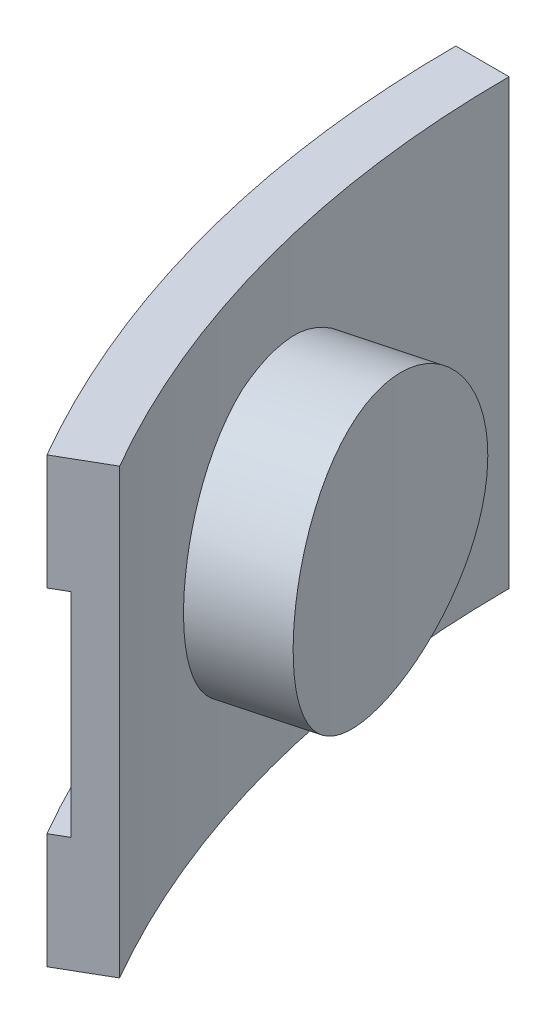
ISO-10303-21;
HEADER;
FILE_DESCRIPTION(('STEP AP214'),'2;1');
FILE_NAME('part.step','',(''),(''),'','','');
FILE_SCHEMA(('AUTOMOTIVE_DESIGN { 1 0 10303 214 1 1 1 1 }'));
ENDSEC;
DATA;
#1=APPLICATION_CONTEXT('core data for automotive mechanical design processes');
#2=APPLICATION_PROTOCOL_DEFINITION('international standard','automotive_design',2000,#1);
#3=PRODUCT_CONTEXT('',#1,'mechanical');
#4=PRODUCT('Part','Part','',(#3));
#5=PRODUCT_RELATED_PRODUCT_CATEGORY('part','',(#4));
#6=PRODUCT_DEFINITION_FORMATION('','',#4);
#7=PRODUCT_DEFINITION_CONTEXT('part definition',#1,'design');
#8=PRODUCT_DEFINITION('design','',#6,#7);
#9=PRODUCT_DEFINITION_SHAPE('','',#8);
#10=(LENGTH_UNIT() NAMED_UNIT(*) SI_UNIT(.MILLI.,.METRE.));
#11=(NAMED_UNIT(*) PLANE_ANGLE_UNIT() SI_UNIT($,.RADIAN.));
#12=(NAMED_UNIT(*) SI_UNIT($,.STERADIAN.) SOLID_ANGLE_UNIT());
#13=UNCERTAINTY_MEASURE_WITH_UNIT(LENGTH_MEASURE(1.E-05),#10,'distance_accuracy_value','');
#14=(GEOMETRIC_REPRESENTATION_CONTEXT(3) GLOBAL_UNCERTAINTY_ASSIGNED_CONTEXT((#13)) GLOBAL_UNIT_ASSIGNED_CONTEXT((#10,
#11,#12)) REPRESENTATION_CONTEXT('',''));
#15=CARTESIAN_POINT('',(0.,0.,0.));
#16=DIRECTION('',(0.,0.,1.));
#17=DIRECTION('',(1.,0.,0.));
#18=AXIS2_PLACEMENT_3D('',#15,#16,#17);
#19=CARTESIAN_POINT('',(-73.5490194829614,15.875,19.7074003745605));
#20=DIRECTION('',(0.965925826289068,0.,-0.258819045102521));
#21=DIRECTION('',(-0.258819045102521,0.,-0.965925826289068));
#22=AXIS2_PLACEMENT_3D('',#19,#20,#21);
#23=CYLINDRICAL_SURFACE('',#22,9.85774);
#24=CARTESIAN_POINT('',(-73.5490194829614,15.875,19.7074003745605));
#25=DIRECTION('',(-0.965925826289068,0.,0.258819045102522));
#26=DIRECTION('',(0.258819045102522,0.,0.965925826289068));
#27=AXIS2_PLACEMENT_3D('',#24,#25,#26);
#28=CIRCLE('',#27,9.85774);
#29=CARTESIAN_POINT('',(-72.7900084805918,25.2864257334295,22.5400679989073));
#30=VERTEX_POINT('',#29);
#31=CARTESIAN_POINT('',(-74.3080304853309,25.2864257334295,16.8747327502136));
#32=VERTEX_POINT('',#31);
#33=EDGE_CURVE('E62',#30,#32,#28,.T.);
#34=ORIENTED_EDGE('',*,*,#33,.F.);
#35=CARTESIAN_POINT('',(-72.7900084805916,25.2864257334292,22.540067998908));
#36=CARTESIAN_POINT('',(-72.7115959923994,25.2039061051562,22.7933290368466));
#37=CARTESIAN_POINT('',(-72.6328766696827,25.1101620584665,23.0428265124326));
#38=CARTESIAN_POINT('',(-72.4756574732728,24.9010450120283,23.5326318211818));
#39=CARTESIAN_POINT('',(-72.3971575810755,24.7856738955483,23.7729404523106));
#40=CARTESIAN_POINT('',(-72.2412605894769,24.5342114415687,24.2425569306728));
#41=CARTESIAN_POINT('',(-72.1638626358322,24.3981372309854,24.47187366677));
#42=CARTESIAN_POINT('',(-72.0109633772148,24.106186061515,24.9182016937162));
#43=CARTESIAN_POINT('',(-71.9354620704932,23.9503091208894,25.1352129959126));
#44=CARTESIAN_POINT('',(-71.7872038526243,23.6198104536868,25.5555682169199));
#45=CARTESIAN_POINT('',(-71.7144477220045,23.4451834494351,25.7589082612844));
#46=CARTESIAN_POINT('',(-71.572568821435,23.0784455629738,26.1505406867446));
#47=CARTESIAN_POINT('',(-71.5034461358656,22.8863342750056,26.3388327184299));
#48=CARTESIAN_POINT('',(-71.3696966252877,22.4860001945479,26.6991261181297));
#49=CARTESIAN_POINT('',(-71.3050691932425,22.2777795855059,26.8711296868682));
#50=CARTESIAN_POINT('',(-71.1811205878822,21.84665397407,27.1977682273536));
#51=CARTESIAN_POINT('',(-71.1217994028418,21.6237490041261,27.3524032374801));
#52=CARTESIAN_POINT('',(-71.0090780205629,21.1641536854681,27.6437210178733));
#53=CARTESIAN_POINT('',(-70.9556951013204,20.927426016292,27.7803516049112));
#54=CARTESIAN_POINT('',(-70.8557659940757,20.4424314353353,28.0342477576477));
#55=CARTESIAN_POINT('',(-70.8092196285852,20.1941648233451,28.1515138260909));
#56=CARTESIAN_POINT('',(-70.7235998917721,19.6878099832105,28.3659259486356));
#57=CARTESIAN_POINT('',(-70.6845274197345,19.4297205776268,28.4630695816513));
#58=CARTESIAN_POINT('',(-70.6144143554604,18.9055867756403,28.6365718639119));
#59=CARTESIAN_POINT('',(-70.5833737167158,18.6395424253102,28.7129306335108));
#60=CARTESIAN_POINT('',(-70.5299034283842,18.1027430782981,28.8440238849635));
#61=CARTESIAN_POINT('',(-70.5074318204802,17.8320180016836,28.8988637735374));
#62=CARTESIAN_POINT('',(-70.4712070370088,17.2865182726384,28.9870877681937));
#63=CARTESIAN_POINT('',(-70.4574538367601,17.0117436316741,29.0204719350154));
#64=CARTESIAN_POINT('',(-70.4388673526299,16.460149165276,29.0655562929141));
#65=CARTESIAN_POINT('',(-70.4340331720173,16.1833295482572,29.0772586639102));
#66=CARTESIAN_POINT('',(-70.4333528909975,15.629615093394,29.0789064759611));
#67=CARTESIAN_POINT('',(-70.4375067541219,15.3527202558594,29.0688520052928));
#68=CARTESIAN_POINT('',(-70.4546844585434,14.8026772750012,29.0271930869861));
#69=CARTESIAN_POINT('',(-70.4676495196361,14.5295164644566,28.9957314466364));
#70=CARTESIAN_POINT('',(-70.5022021630677,13.9870316472714,28.9116162439496));
#71=CARTESIAN_POINT('',(-70.5237897049706,13.717707622644,28.858962780994));
#72=CARTESIAN_POINT('',(-70.5752799507137,13.1847925691509,28.7328121725538));
#73=CARTESIAN_POINT('',(-70.6051828241743,12.9212016573506,28.6593146018795));
#74=CARTESIAN_POINT('',(-70.6728828956562,12.4016068209442,28.4919596312027));
#75=CARTESIAN_POINT('',(-70.7106801151596,12.1456029169862,28.3981021757967));
#76=CARTESIAN_POINT('',(-70.7937285729691,11.6424668941259,28.1904330750717));
#77=CARTESIAN_POINT('',(-70.8389944128966,11.3953533326052,28.0765823129611));
#78=CARTESIAN_POINT('',(-70.9363133114128,10.9122403452468,27.8297869099681));
#79=CARTESIAN_POINT('',(-70.988366558597,10.6762412284843,27.6968417385164));
#80=CARTESIAN_POINT('',(-71.0985780866359,10.2169511319801,27.4126870326949));
#81=CARTESIAN_POINT('',(-71.156737428505,9.99366237126041,27.2614743234096));
#82=CARTESIAN_POINT('',(-71.2784001688551,9.56137535379539,26.9417689155581));
#83=CARTESIAN_POINT('',(-71.3419034886992,9.35237688684957,26.7732764712562));
#84=CARTESIAN_POINT('',(-71.4739782424367,8.94850544423065,26.4186771250702));
#85=CARTESIAN_POINT('',(-71.5425858659359,8.75375759589395,26.232441162435));
#86=CARTESIAN_POINT('',(-71.6835670263624,8.3816006168212,25.8447047624332));
#87=CARTESIAN_POINT('',(-71.7559404927506,8.20419116149334,25.6432046109528));
#88=CARTESIAN_POINT('',(-71.9035337171051,7.86807353264595,25.2263881710438));
#89=CARTESIAN_POINT('',(-71.978751446885,7.70935235316056,25.0110816541737));
#90=CARTESIAN_POINT('',(-72.131182671911,7.41164361853441,24.568015637518));
#91=CARTESIAN_POINT('',(-72.2083954986086,7.27264955174396,24.3402602814683));
#92=CARTESIAN_POINT('',(-72.3695787291819,7.00607907776787,23.8569352254301));
#93=CARTESIAN_POINT('',(-72.453635758925,6.88004275037505,23.6005431756531));
#94=CARTESIAN_POINT('',(-72.6219170861906,6.65293828533109,23.0775455299615));
#95=CARTESIAN_POINT('',(-72.7061408601541,6.55182826786991,22.8109579468801));
#96=CARTESIAN_POINT('',(-72.7900084805916,6.46357426657067,22.540067998908));
#97=B_SPLINE_CURVE_WITH_KNOTS('',3,(#35,#36,#37,#38,#39,#40,#41,#42,#43,#44,#45,#46,#47,#48,#49,
#50,#51,#52,#53,#54,#55,#56,#57,#58,#59,#60,#61,#62,#63,#64,#65,#66,#67,#68,#69,#70,#71,#72,#73,
#74,#75,#76,#77,#78,#79,#80,#81,#82,#83,#84,#85,#86,#87,#88,#89,#90,#91,#92,#93,#94,#95,#96),
.UNSPECIFIED.,.F.,.F.,(4,2,2,2,2,2,2,2,2,2,2,2,2,2,2,2,2,2,2,2,2,2,2,2,2,2,2,2,2,2,4),(0.,
0.832737922619129,1.66540336471879,2.49738368123657,3.3293632305277,4.16157757824983,
4.99381124413368,5.82593230653548,6.65805153014647,7.49253183544433,8.3269904724311,
9.16154945134737,9.99610359767776,10.8265172035651,11.656928458606,12.4872562183641,
13.3175806091345,14.142419518116,14.9672545589648,15.792106426467,16.6169605385934,
17.4434468279623,18.2699560870475,19.0966092014529,19.9232501537367,20.7564449156394,
21.589624076325,22.4222199213288,23.2545402954654,24.1467205359899,25.037391409025),.UNSPECIFIED.);
#98=CARTESIAN_POINT('',(-72.7900084805918,6.46357426657044,22.5400679989073));
#99=VERTEX_POINT('',#98);
#100=EDGE_CURVE('E124',#30,#99,#97,.T.);
#101=ORIENTED_EDGE('',*,*,#100,.T.);
#102=CARTESIAN_POINT('',(-74.3080304853309,6.46357426657044,16.8747327502136));
#103=VERTEX_POINT('',#102);
#104=EDGE_CURVE('E66',#103,#99,#28,.T.);
#105=ORIENTED_EDGE('',*,*,#104,.F.);
#106=CARTESIAN_POINT('',(-74.3080304853311,6.46357426657067,16.8747327502129));
#107=CARTESIAN_POINT('',(-74.366753797552,6.54609389484374,16.6161960134731));
#108=CARTESIAN_POINT('',(-74.4233296021035,6.63983794153346,16.3607652000772));
#109=CARTESIAN_POINT('',(-74.5320764384246,6.84895498797166,15.857971761587));
#110=CARTESIAN_POINT('',(-74.5842478531518,6.96432610445158,15.6106084361822));
#111=CARTESIAN_POINT('',(-74.6840453372349,7.21578855843121,15.1259601400854));
#112=CARTESIAN_POINT('',(-74.7316751112264,7.35186276901449,14.8886670442899));
#113=CARTESIAN_POINT('',(-74.822424482517,7.64381393848493,14.4256860052249));
#114=CARTESIAN_POINT('',(-74.8655440839753,7.79969087911049,14.1999980512536));
#115=CARTESIAN_POINT('',(-74.9473263114847,8.13018954631315,13.7618306423134));
#116=CARTESIAN_POINT('',(-74.9859876762691,8.30481655056481,13.5493549329773));
#117=CARTESIAN_POINT('',(-75.058933156845,8.67155443702613,13.1392518532982));
#118=CARTESIAN_POINT('',(-75.0932171710068,8.86366572499434,12.9416248277438));
#119=CARTESIAN_POINT('',(-75.1575333969525,9.26399980545197,12.5627268354991));
#120=CARTESIAN_POINT('',(-75.1875661833893,9.472220414494,12.3814536594073));
#121=CARTESIAN_POINT('',(-75.2435428126263,9.90334602592994,12.0366020828117));
#122=CARTESIAN_POINT('',(-75.269486664462,10.1262509958738,11.8730236432075));
#123=CARTESIAN_POINT('',(-75.3175259740553,10.5858463145318,11.5643743536734));
#124=CARTESIAN_POINT('',(-75.3396103033821,10.8225739837079,11.4193573347435));
#125=CARTESIAN_POINT('',(-75.3800172342989,11.3075685646646,11.1495122629281));
#126=CARTESIAN_POINT('',(-75.398339933552,11.5558351766548,11.0246836859091));
#127=CARTESIAN_POINT('',(-75.4313971276788,12.0621900167894,10.7961874724995));
#128=CARTESIAN_POINT('',(-75.4461311908134,12.3202794223731,10.6925223824732));
#129=CARTESIAN_POINT('',(-75.4721626371451,12.8444132243596,10.5072084662839));
#130=CARTESIAN_POINT('',(-75.4834600402421,13.1104575746897,10.4255595126372));
#131=CARTESIAN_POINT('',(-75.5027000379256,13.6472569217018,10.2852942824487));
#132=CARTESIAN_POINT('',(-75.5106589989039,13.9179819983164,10.226565741851));
#133=CARTESIAN_POINT('',(-75.5233994134991,14.4634817273615,10.1320491295196));
#134=CARTESIAN_POINT('',(-75.5281808761113,14.7382563683258,10.0962609928435));
#135=CARTESIAN_POINT('',(-75.5346266876368,15.2898508347239,10.0479235515248));
#136=CARTESIAN_POINT('',(-75.5362913499179,15.5666704517427,10.0353719106514));
#137=CARTESIAN_POINT('',(-75.5365261152985,16.1203849066059,10.0336047230447));
#138=CARTESIAN_POINT('',(-75.5350962309539,16.3972797441405,10.0443890816273));
#139=CARTESIAN_POINT('',(-75.5291431002084,16.9473227249988,10.0890556153858));
#140=CARTESIAN_POINT('',(-75.5246403523013,17.2204835355434,10.1227847257197));
#141=CARTESIAN_POINT('',(-75.5125062179376,17.7629683527285,10.2129069498068));
#142=CARTESIAN_POINT('',(-75.504874846153,18.0322923773559,10.269299957275));
#143=CARTESIAN_POINT('',(-75.4863914027935,18.565207430849,10.4042947117586));
#144=CARTESIAN_POINT('',(-75.4755392655193,18.8287983426493,10.4828969118093));
#145=CARTESIAN_POINT('',(-75.4504917619223,19.3483931790557,10.661680603606));
#146=CARTESIAN_POINT('',(-75.4362963865017,19.6043970830137,10.7618621540739));
#147=CARTESIAN_POINT('',(-75.4043839103474,20.107533105874,10.9832330997875));
#148=CARTESIAN_POINT('',(-75.3866598965929,20.3546466673947,11.1044636719793));
#149=CARTESIAN_POINT('',(-75.3475428334798,20.8377596547531,11.3668542097665));
#150=CARTESIAN_POINT('',(-75.3261496821649,21.0737587715157,11.5080147291463));
#151=CARTESIAN_POINT('',(-75.2795183123257,21.5330488680198,11.809205687012));
#152=CARTESIAN_POINT('',(-75.2542794252091,21.7563376287395,11.9692394055627));
#153=CARTESIAN_POINT('',(-75.1997897451206,22.1886246462045,12.3069437806644));
#154=CARTESIAN_POINT('',(-75.1705390111792,22.3976231131503,12.4846141776977));
#155=CARTESIAN_POINT('',(-75.1076194300215,22.8014945557693,12.8577435965289));
#156=CARTESIAN_POINT('',(-75.0739173935475,22.996242404106,13.0533324830188));
#157=CARTESIAN_POINT('',(-75.002142459931,23.3683993831787,13.4596126356055));
#158=CARTESIAN_POINT('',(-74.9640696446428,23.5458088385066,13.670303618848));
#159=CARTESIAN_POINT('',(-74.8834809064058,23.881926467354,14.1050738567015));
#160=CARTESIAN_POINT('',(-74.8409681127752,24.0406476468394,14.3291436348013));
#161=CARTESIAN_POINT('',(-74.7514444176498,24.3383563814655,14.7890656732917));
#162=CARTESIAN_POINT('',(-74.7044350090431,24.477350448256,15.0249140108275));
#163=CARTESIAN_POINT('',(-74.6023612533645,24.743920922232,15.5240774029287));
#164=CARTESIAN_POINT('',(-74.5469607516002,24.8699572496249,15.7881479462355));
#165=CARTESIAN_POINT('',(-74.4311978331489,25.0970617146688,16.3252178571567));
#166=CARTESIAN_POINT('',(-74.3708439694632,25.19817173213,16.5982013634205));
#167=CARTESIAN_POINT('',(-74.3080304853311,25.2864257334292,16.8747327502129));
#168=B_SPLINE_CURVE_WITH_KNOTS('',3,(#106,#107,#108,#109,#110,#111,#112,#113,#114,#115,#116,
#117,#118,#119,#120,#121,#122,#123,#124,#125,#126,#127,#128,#129,#130,#131,#132,#133,#134,#135,
#136,#137,#138,#139,#140,#141,#142,#143,#144,#145,#146,#147,#148,#149,#150,#151,#152,#153,#154,
#155,#156,#157,#158,#159,#160,#161,#162,#163,#164,#165,#166,#167),.UNSPECIFIED.,.F.,.F.,(4,2,2,
2,2,2,2,2,2,2,2,2,2,2,2,2,2,2,2,2,2,2,2,2,2,2,2,2,2,2,4),(0.,0.832737922619133,1.66540336471879,
2.49738368123657,3.3293632305277,4.16157757824983,4.99381124413367,5.82593230653547,
6.65805153014646,7.49253183544431,8.32699047243109,9.16154945134737,9.99610359767776,
10.826517203565,11.656928458606,12.4872562183641,13.3175806091345,14.142419518116,
14.9672545589648,15.792106426467,16.6169605385934,17.4434468279623,18.2699560870475,
19.0966092014529,19.9232501537367,20.7564449156394,21.589624076325,22.4222199213288,
23.2545402954654,24.1467205359899,25.037391409025),.UNSPECIFIED.);
#169=EDGE_CURVE('E11',#103,#32,#168,.T.);
#170=ORIENTED_EDGE('',*,*,#169,.T.);
#171=EDGE_LOOP('',(#34,#101,#105,#170));
#172=FACE_BOUND('',#171,.T.);
#173=CARTESIAN_POINT('',(-69.3460145060104,15.875,8.37572517052677));
#174=CARTESIAN_POINT('',(-69.3460140954335,16.1504694989224,8.37572140637769));
#175=CARTESIAN_POINT('',(-69.3446180820444,16.4258887042411,8.38730919425372));
#176=CARTESIAN_POINT('',(-69.3390088767182,16.9748404046877,8.43355920137593));
#177=CARTESIAN_POINT('',(-69.3347950744239,17.2483724780747,8.46822641981734));
#178=CARTESIAN_POINT('',(-69.3234755627745,17.7917414031861,8.56039606940945));
#179=CARTESIAN_POINT('',(-69.31636730682,18.0615747840739,8.61791860805578));
#180=CARTESIAN_POINT('',(-69.2991459027555,18.5953946111041,8.75532224289301));
#181=CARTESIAN_POINT('',(-69.2890327059633,18.8593809624457,8.83520370131351));
#182=CARTESIAN_POINT('',(-69.2656603200205,19.3794411544467,9.01660406408775));
#183=CARTESIAN_POINT('',(-69.2524035195296,19.6355208368033,9.11810653383962));
#184=CARTESIAN_POINT('',(-69.2225598716294,20.1381942289788,9.34197238849871));
#185=CARTESIAN_POINT('',(-69.2059729827145,20.384787820519,9.46433603341315));
#186=CARTESIAN_POINT('',(-69.169274249522,20.8667015569959,9.72891677760827));
#187=CARTESIAN_POINT('',(-69.1491635629352,21.1020253722169,9.87112735336434));
#188=CARTESIAN_POINT('',(-69.1051944065506,21.5599464723501,10.1743834270402));
#189=CARTESIAN_POINT('',(-69.081334712479,21.7825395674229,10.3354350732853));
#190=CARTESIAN_POINT('',(-69.0294999386208,22.2147290886037,10.6761653648991));
#191=CARTESIAN_POINT('',(-69.0015003061214,22.4242365665918,10.8559531086732));
#192=CARTESIAN_POINT('',(-68.9412923930145,22.8272937185199,11.2319608347772));
#193=CARTESIAN_POINT('',(-68.9090840982268,23.0208433386899,11.4281808724713));
#194=CARTESIAN_POINT('',(-68.840271679081,23.390683105723,11.8356318663554));
#195=CARTESIAN_POINT('',(-68.8036665530574,23.5669693030459,12.0468662385493));
#196=CARTESIAN_POINT('',(-68.7259383720394,23.9009390260292,12.4826622763588));
#197=CARTESIAN_POINT('',(-68.6848169021545,24.0586290383879,12.707219253472));
#198=CARTESIAN_POINT('',(-68.5977619330586,24.3550172311209,13.1690932607191));
#199=CARTESIAN_POINT('',(-68.5518079327966,24.4936282253588,13.4064623886176));
#200=CARTESIAN_POINT('',(-68.4552105710057,24.7500246116675,13.8912825859959));
#201=CARTESIAN_POINT('',(-68.4045671919296,24.8678099258058,14.1387336931996));
#202=CARTESIAN_POINT('',(-68.2986395059851,25.0816838258624,14.6418722520068));
#203=CARTESIAN_POINT('',(-68.2433553683724,25.1777732025942,14.8975594030195));
#204=CARTESIAN_POINT('',(-68.1282757943415,25.3475417916543,15.4152796923374));
#205=CARTESIAN_POINT('',(-68.068480390234,25.4212211644692,15.6773127851823));
#206=CARTESIAN_POINT('',(-67.9450136770172,25.5451977731291,16.2040208588319));
#207=CARTESIAN_POINT('',(-67.8813708112463,25.5956473582734,16.4686666514875));
#208=CARTESIAN_POINT('',(-67.7501663017251,25.6735018135853,17.0003659065763));
#209=CARTESIAN_POINT('',(-67.682604673583,25.7009067755318,17.2674193594163));
#210=CARTESIAN_POINT('',(-67.5439735207645,25.7324624817791,17.8019768408367));
#211=CARTESIAN_POINT('',(-67.4729041496044,25.7366142428476,18.0694808492044));
#212=CARTESIAN_POINT('',(-67.3277560534524,25.7216344540326,18.6030157772869));
#213=CARTESIAN_POINT('',(-67.2536773399481,25.7025029930198,18.8690467026205));
#214=CARTESIAN_POINT('',(-67.1036368655818,25.6413221501828,19.3958474332307));
#215=CARTESIAN_POINT('',(-67.0276922686697,25.5994369238903,19.6566412120438));
#216=CARTESIAN_POINT('',(-66.8740740254512,25.493172006685,20.1730836591458));
#217=CARTESIAN_POINT('',(-66.7964003886945,25.4287924399823,20.4287323558366));
#218=CARTESIAN_POINT('',(-66.6400473322938,25.2780145478487,20.9331392125493));
#219=CARTESIAN_POINT('',(-66.5613678966593,25.1916158719347,21.1818972628213));
#220=CARTESIAN_POINT('',(-66.4037864264597,24.9974316946462,21.6708475247582));
#221=CARTESIAN_POINT('',(-66.3248843907585,24.8896460839269,21.911039692621));
#222=CARTESIAN_POINT('',(-66.1674348863309,24.6530879964051,22.3820222161246));
#223=CARTESIAN_POINT('',(-66.0888893473715,24.5242497681475,22.6127801895208));
#224=CARTESIAN_POINT('',(-65.9332458588277,24.2466988865592,23.0626597712879));
#225=CARTESIAN_POINT('',(-65.8561484612928,24.0979788226183,23.2817769980097));
#226=CARTESIAN_POINT('',(-65.7043460175285,23.7818045981969,23.7067991944398));
#227=CARTESIAN_POINT('',(-65.6296401165705,23.6143572292756,23.9127089115697));
#228=CARTESIAN_POINT('',(-65.4834491162382,23.2617671610248,24.3101884697596));
#229=CARTESIAN_POINT('',(-65.4119654992357,23.0766164372984,24.5017517371814));
#230=CARTESIAN_POINT('',(-65.2725315611414,22.6882697294195,24.8708340892248));
#231=CARTESIAN_POINT('',(-65.2046174841101,22.4849304746773,25.0482161488809));
#232=CARTESIAN_POINT('',(-65.0739107876843,22.0631181384774,25.3858504265438));
#233=CARTESIAN_POINT('',(-65.0111158877899,21.8446518769301,25.5461102821711));
#234=CARTESIAN_POINT('',(-64.891426065035,21.3939256164503,25.8486325856681));
#235=CARTESIAN_POINT('',(-64.8345336608812,21.1616597949275,25.9908873560758));
#236=CARTESIAN_POINT('',(-64.7274817596127,20.6851290939638,26.2563533383516));
#237=CARTESIAN_POINT('',(-64.6773197039914,20.4408688226604,26.3795717894897));
#238=CARTESIAN_POINT('',(-64.5843715435559,19.9417712479527,26.6063242192615));
#239=CARTESIAN_POINT('',(-64.5415916225836,19.6869252967333,26.7098417022498));
#240=CARTESIAN_POINT('',(-64.4640778208165,19.168651302621,26.8963822970387));
#241=CARTESIAN_POINT('',(-64.429343951446,18.9052232475432,26.9794053797401));
#242=CARTESIAN_POINT('',(-64.3684369785305,18.371681903742,27.1243988073326));
#243=CARTESIAN_POINT('',(-64.3422634403421,18.1015689551876,27.18637022111));
#244=CARTESIAN_POINT('',(-64.2988681149613,17.5565939707929,27.2888468245649));
#245=CARTESIAN_POINT('',(-64.2816462590805,17.28173197141,27.3293521789566));
#246=CARTESIAN_POINT('',(-64.2565242839839,16.7316298255141,27.3883662813447));
#247=CARTESIAN_POINT('',(-64.2485453482867,16.4564132164767,27.4070610233109));
#248=CARTESIAN_POINT('',(-64.241763058767,15.9052479051376,27.4229548937246));
#249=CARTESIAN_POINT('',(-64.2429596527068,15.6292992070128,27.4201541445493));
#250=CARTESIAN_POINT('',(-64.2545101622158,15.0786578030144,27.3930764769267));
#251=CARTESIAN_POINT('',(-64.2648638392223,14.8039650646076,27.3688001179675));
#252=CARTESIAN_POINT('',(-64.2945725140571,14.2577960981474,27.2989355634143));
#253=CARTESIAN_POINT('',(-64.3139275049218,13.9863198676059,27.2533473843075));
#254=CARTESIAN_POINT('',(-64.361245838485,13.4497016483213,27.1414112342504));
#255=CARTESIAN_POINT('',(-64.3891709824301,13.1845370683915,27.075155361921));
#256=CARTESIAN_POINT('',(-64.4532501347083,12.6611737741141,26.9222568045496));
#257=CARTESIAN_POINT('',(-64.4894041109337,12.402975032591,26.835614199054));
#258=CARTESIAN_POINT('',(-64.5694175353314,11.8953713978215,26.6425173657616));
#259=CARTESIAN_POINT('',(-64.613275920548,11.6459652971709,26.5360658708219));
#260=CARTESIAN_POINT('',(-64.7081031676705,11.1575404200552,26.3039843820455));
#261=CARTESIAN_POINT('',(-64.7590745182802,10.9185253177763,26.1783476741771));
#262=CARTESIAN_POINT('',(-64.8677715023293,10.4510888902565,25.9078385129492));
#263=CARTESIAN_POINT('',(-64.9255389776717,10.2227467313158,25.7628460678007));
#264=CARTESIAN_POINT('',(-65.0467786915539,9.77990457520651,25.4551843482754));
#265=CARTESIAN_POINT('',(-65.1102509685804,9.56540467143969,25.2925149546418));
#266=CARTESIAN_POINT('',(-65.2420812376666,9.15167677065035,24.9504894197659));
#267=CARTESIAN_POINT('',(-65.3104402818119,8.95245208152181,24.7711296826901));
#268=CARTESIAN_POINT('',(-65.4511366931173,8.57076401439634,24.3969492613379));
#269=CARTESIAN_POINT('',(-65.5234726885353,8.38829491428131,24.2021338979185));
#270=CARTESIAN_POINT('',(-65.6718088772496,8.03999859365591,23.7967004349255));
#271=CARTESIAN_POINT('',(-65.7478325353166,7.87430684353786,23.585974512504));
#272=CARTESIAN_POINT('',(-65.9021154634486,7.56231894943829,23.1513894688203));
#273=CARTESIAN_POINT('',(-65.9803747460859,7.41602291455808,22.9275302736935));
#274=CARTESIAN_POINT('',(-66.1382153436971,7.14388272827513,22.468154023237));
#275=CARTESIAN_POINT('',(-66.2177966360567,7.01803822742457,22.2326371671873));
#276=CARTESIAN_POINT('',(-66.3773925826044,6.78771887886353,21.7515167529218));
#277=CARTESIAN_POINT('',(-66.4574072344897,6.68324391770714,21.505913248262));
#278=CARTESIAN_POINT('',(-66.616751386297,6.49675031037677,21.0071236719259));
#279=CARTESIAN_POINT('',(-66.6960822806297,6.41465802473735,20.7539655814861));
#280=CARTESIAN_POINT('',(-66.8535336362483,6.27308589453066,20.2410351924437));
#281=CARTESIAN_POINT('',(-66.9316540992121,6.21360601861469,19.9812629030111));
#282=CARTESIAN_POINT('',(-67.0859495737446,6.11771219867468,19.4569407297294));
#283=CARTESIAN_POINT('',(-67.1621246800281,6.08129712961699,19.1923910795536));
#284=CARTESIAN_POINT('',(-67.3118765006126,6.03180729176973,18.6603896171019));
#285=CARTESIAN_POINT('',(-67.3854532313956,6.01873237490177,18.3929378232492));
#286=CARTESIAN_POINT('',(-67.5288096471064,6.01603445860399,17.859395587304));
#287=CARTESIAN_POINT('',(-67.5986167813549,6.02620856433914,17.5933135240202));
#288=CARTESIAN_POINT('',(-67.7346459648264,6.06951372181104,17.0621044430603));
#289=CARTESIAN_POINT('',(-67.8008680362909,6.1026446311079,16.7969774194686));
#290=CARTESIAN_POINT('',(-67.9293497528065,6.19161364608485,16.269591482323));
#291=CARTESIAN_POINT('',(-67.9916094193617,6.24745162852076,16.0073325532103));
#292=CARTESIAN_POINT('',(-68.1118828101434,6.38141814253362,15.4875781933401));
#293=CARTESIAN_POINT('',(-68.1698965243304,6.4595467268141,15.2300827738471));
#294=CARTESIAN_POINT('',(-68.2814521766011,6.6374662920841,14.7218693780772));
#295=CARTESIAN_POINT('',(-68.3349967005784,6.73724462442278,14.4711475401794));
#296=CARTESIAN_POINT('',(-68.437544794614,6.95776574369945,13.9781387943861));
#297=CARTESIAN_POINT('',(-68.4865483703033,7.0785085046397,13.735851876031));
#298=CARTESIAN_POINT('',(-68.57997662289,7.34006857747761,13.2615132992768));
#299=CARTESIAN_POINT('',(-68.6244022462498,7.48088172554611,13.0294595309374));
#300=CARTESIAN_POINT('',(-68.7087458498845,7.78167796065436,12.5771106030442));
#301=CARTESIAN_POINT('',(-68.7486617930178,7.94166964442037,12.3568207810813));
#302=CARTESIAN_POINT('',(-68.8243755627193,8.28106683374819,11.927935674645));
#303=CARTESIAN_POINT('',(-68.8601364345548,8.46062253827239,11.7194527094527));
#304=CARTESIAN_POINT('',(-68.9272879701575,8.83670969355382,11.3178144009255));
#305=CARTESIAN_POINT('',(-68.9586804670288,9.03323396733553,11.1246526430631));
#306=CARTESIAN_POINT('',(-69.0173111531222,9.44205515933624,10.7549208552595));
#307=CARTESIAN_POINT('',(-69.0445474502107,9.65435919636476,10.5783583962022));
#308=CARTESIAN_POINT('',(-69.0950555311776,10.0931901171204,10.2432670961885));
#309=CARTESIAN_POINT('',(-69.1183273629773,10.3197168288819,10.0847380372562));
#310=CARTESIAN_POINT('',(-69.1612304698137,10.7865867834586,9.78619264647624));
#311=CARTESIAN_POINT('',(-69.1808430793927,11.0269930902239,9.64627222341444));
#312=CARTESIAN_POINT('',(-69.2165015028081,11.5188948716994,9.38698846966912));
#313=CARTESIAN_POINT('',(-69.2325473678567,11.7703901871286,9.26762484383103));
#314=CARTESIAN_POINT('',(-69.2612636743736,12.2824631648409,9.05051651875043));
#315=CARTESIAN_POINT('',(-69.2739372456446,12.5430321500718,8.95275178812757));
#316=CARTESIAN_POINT('',(-69.2961039304082,13.0715210252398,8.77952636452605));
#317=CARTESIAN_POINT('',(-69.3055977711195,13.3394392191939,8.70406057214445));
#318=CARTESIAN_POINT('',(-69.324501634803,13.9806662075123,8.55242183032372));
#319=CARTESIAN_POINT('',(-69.3325909682659,14.3564222565206,8.48624071458463));
#320=CARTESIAN_POINT('',(-69.3433476585141,15.1131509567046,8.39789522394899));
#321=CARTESIAN_POINT('',(-69.3460150736924,15.4941235516549,8.37573037500762));
#322=CARTESIAN_POINT('',(-69.3460145060104,15.875,8.37572517052677));
#323=B_SPLINE_CURVE_WITH_KNOTS('',3,(#173,#174,#175,#176,#177,#178,#179,#180,#181,#182,#183,
#184,#185,#186,#187,#188,#189,#190,#191,#192,#193,#194,#195,#196,#197,#198,#199,#200,#201,#202,
#203,#204,#205,#206,#207,#208,#209,#210,#211,#212,#213,#214,#215,#216,#217,#218,#219,#220,#221,
#222,#223,#224,#225,#226,#227,#228,#229,#230,#231,#232,#233,#234,#235,#236,#237,#238,#239,#240,
#241,#242,#243,#244,#245,#246,#247,#248,#249,#250,#251,#252,#253,#254,#255,#256,#257,#258,#259,
#260,#261,#262,#263,#264,#265,#266,#267,#268,#269,#270,#271,#272,#273,#274,#275,#276,#277,#278,
#279,#280,#281,#282,#283,#284,#285,#286,#287,#288,#289,#290,#291,#292,#293,#294,#295,#296,#297,
#298,#299,#300,#301,#302,#303,#304,#305,#306,#307,#308,#309,#310,#311,#312,#313,#314,#315,#316,
#317,#318,#319,#320,#321,#322),.UNSPECIFIED.,.T.,.F.,(4,2,2,2,2,2,2,2,2,2,2,2,2,2,2,2,2,2,2,2,2,
2,2,2,2,2,2,2,2,2,2,2,2,2,2,2,2,2,2,2,2,2,2,2,2,2,2,2,2,2,2,2,2,2,2,2,2,2,2,2,2,2,2,2,2,2,2,2,2,
2,2,2,2,2,4),(0.,0.826074909281893,1.65232881145464,2.47931124486542,3.30630707672573,
4.13267652005266,4.95905626374558,5.78516502008503,6.61154411287682,7.44303690998271,
8.27453250869444,9.10621789540669,9.93761231112676,10.7726880780028,11.6077669697805,
12.4428154181512,13.2778578862798,14.1073429840553,14.9368247782551,15.7662703023123,
16.5957126604352,17.4192490285289,18.2427808492651,19.0663257791629,19.8898749196984,
20.7160471327296,21.5425281502303,22.3687104058906,23.1952689365154,24.0290347497764,
24.8624270824966,25.6961735893432,26.5296022483753,27.3637256973686,28.1978503307008,
29.0319326055085,29.8660084801101,30.6929183925,31.5198235971692,32.346707259728,
33.1735902825963,33.9968399848335,34.8200864749079,35.6432194730416,36.4666411966816,
37.2954276806124,38.124219756267,38.9531908053972,39.7818776956221,40.6167965146085,
41.4517200298319,42.2866292775244,43.1215340927635,43.9536579671184,44.785780687855,
45.6178628169584,46.4499396670121,47.274782722509,48.0996206601544,48.924454120995,
49.7492895320738,50.5736443326197,51.3979981109004,52.2221811159101,53.046734949968,
53.8781368159497,54.7091887412738,55.5406178861381,56.3720369801652,57.2075875947568,
58.0431262115096,58.8778866442716,59.7124560329549,60.8546364460953,61.9968045581548),.UNSPECIFIED.);
#324=CARTESIAN_POINT('',(-69.3460145060104,15.875,8.37572517052677));
#325=VERTEX_POINT('',#324);
#326=EDGE_CURVE('E45',#325,#325,#323,.T.);
#327=ORIENTED_EDGE('',*,*,#326,.F.);
#328=EDGE_LOOP('',(#327));
#329=FACE_BOUND('',#328,.T.);
#330=ADVANCED_FACE('F41',(#172,#329),#23,.T.);
#331=CARTESIAN_POINT('',(0.,0.,0.));
#332=DIRECTION('',(0.,-1.,0.));
#333=DIRECTION('',(0.,0.,-1.));
#334=AXIS2_PLACEMENT_3D('',#331,#332,#333);
#335=CYLINDRICAL_SURFACE('',#334,76.2);
#336=ORIENTED_EDGE('',*,*,#100,.F.);
#337=DIRECTION('',(0.,-1.,0.));
#338=VECTOR('',#337,1.);
#339=CARTESIAN_POINT('',(-72.7900084805919,0.,22.5400679989073));
#340=LINE('',#339,#338);
#341=EDGE_CURVE('E120',#30,#99,#340,.T.);
#342=ORIENTED_EDGE('',*,*,#341,.T.);
#343=EDGE_LOOP('',(#336,#342));
#344=FACE_BOUND('',#343,.T.);
#345=DIRECTION('',(0.,1.,0.));
#346=VECTOR('',#345,1.);
#347=CARTESIAN_POINT('',(-65.9911357683742,31.75,38.1000000000001));
#348=LINE('',#347,#346);
#349=CARTESIAN_POINT('',(-65.9911357683742,0.,38.1000000000001));
#350=VERTEX_POINT('',#349);
#351=CARTESIAN_POINT('',(-65.9911357683742,31.75,38.1000000000001));
#352=VERTEX_POINT('',#351);
#353=EDGE_CURVE('E209',#350,#352,#348,.T.);
#354=ORIENTED_EDGE('',*,*,#353,.F.);
#355=CARTESIAN_POINT('',(0.,0.,0.));
#356=DIRECTION('',(0.,-1.,0.));
#357=DIRECTION('',(0.,0.,-1.));
#358=AXIS2_PLACEMENT_3D('',#355,#356,#357);
#359=CIRCLE('',#358,76.2);
#360=CARTESIAN_POINT('',(-76.2,0.,0.));
#361=VERTEX_POINT('',#360);
#362=EDGE_CURVE('E229',#350,#361,#359,.T.);
#363=ORIENTED_EDGE('',*,*,#362,.T.);
#364=DIRECTION('',(0.,1.,0.));
#365=VECTOR('',#364,1.);
#366=CARTESIAN_POINT('',(-76.2,31.75,0.));
#367=LINE('',#366,#365);
#368=CARTESIAN_POINT('',(-76.2,31.75,0.));
#369=VERTEX_POINT('',#368);
#370=EDGE_CURVE('E191',#361,#369,#367,.T.);
#371=ORIENTED_EDGE('',*,*,#370,.T.);
#372=CARTESIAN_POINT('',(0.,31.75,0.));
#373=DIRECTION('',(0.,-1.,0.));
#374=DIRECTION('',(0.,0.,-1.));
#375=AXIS2_PLACEMENT_3D('',#372,#373,#374);
#376=CIRCLE('',#375,76.2);
#377=EDGE_CURVE('E231',#352,#369,#376,.T.);
#378=ORIENTED_EDGE('',*,*,#377,.F.);
#379=EDGE_LOOP('',(#354,#363,#371,#378));
#380=FACE_BOUND('',#379,.T.);
#381=ORIENTED_EDGE('',*,*,#169,.F.);
#382=DIRECTION('',(0.,-1.,0.));
#383=VECTOR('',#382,1.);
#384=CARTESIAN_POINT('',(-74.3080304853309,0.,16.8747327502136));
#385=LINE('',#384,#383);
#386=EDGE_CURVE('E55',#103,#32,#385,.F.);
#387=ORIENTED_EDGE('',*,*,#386,.T.);
#388=EDGE_LOOP('',(#381,#387));
#389=FACE_BOUND('',#388,.T.);
#390=ADVANCED_FACE('F133',(#344,#380,#389),#335,.F.);
#391=CARTESIAN_POINT('',(-65.9911357683742,0.,38.1000000000001));
#392=DIRECTION('',(0.,1.,0.));
#393=DIRECTION('',(0.,0.,1.));
#394=AXIS2_PLACEMENT_3D('',#391,#392,#393);
#395=PLANE('',#394);
#396=CARTESIAN_POINT('',(0.,0.,0.));
#397=DIRECTION('',(0.,-1.,0.));
#398=DIRECTION('',(0.,0.,-1.));
#399=AXIS2_PLACEMENT_3D('',#396,#397,#398);
#400=CIRCLE('',#399,80.01);
#401=CARTESIAN_POINT('',(-69.2906925567929,0.,40.0050000000001));
#402=VERTEX_POINT('',#401);
#403=CARTESIAN_POINT('',(-80.01,0.,0.));
#404=VERTEX_POINT('',#403);
#405=EDGE_CURVE('E125',#402,#404,#400,.T.);
#406=ORIENTED_EDGE('',*,*,#405,.T.);
#407=DIRECTION('',(1.,0.,0.));
#408=VECTOR('',#407,1.);
#409=CARTESIAN_POINT('',(-76.2,0.,0.));
#410=LINE('',#409,#408);
#411=EDGE_CURVE('E131',#404,#361,#410,.T.);
#412=ORIENTED_EDGE('',*,*,#411,.T.);
#413=ORIENTED_EDGE('',*,*,#362,.F.);
#414=DIRECTION('',(0.866025403784438,0.,-0.500000000000001));
#415=VECTOR('',#414,1.);
#416=CARTESIAN_POINT('',(-65.9911357683742,0.,38.1000000000001));
#417=LINE('',#416,#415);
#418=EDGE_CURVE('E178',#402,#350,#417,.T.);
#419=ORIENTED_EDGE('',*,*,#418,.F.);
#420=EDGE_LOOP('',(#406,#412,#413,#419));
#421=FACE_BOUND('',#420,.T.);
#422=ADVANCED_FACE('F164',(#421),#395,.F.);
#423=CARTESIAN_POINT('',(0.,0.,0.));
#424=DIRECTION('',(0.,-1.,0.));
#425=DIRECTION('',(0.,0.,-1.));
#426=AXIS2_PLACEMENT_3D('',#423,#424,#425);
#427=CYLINDRICAL_SURFACE('',#426,80.01);
#428=CARTESIAN_POINT('',(0.,8.255,0.));
#429=DIRECTION('',(0.,-1.,0.));
#430=DIRECTION('',(0.,0.,-1.));
#431=AXIS2_PLACEMENT_3D('',#428,#429,#430);
#432=CIRCLE('',#431,80.01);
#433=CARTESIAN_POINT('',(-69.2906925567929,8.255,40.0050000000001));
#434=VERTEX_POINT('',#433);
#435=CARTESIAN_POINT('',(-80.01,8.255,0.));
#436=VERTEX_POINT('',#435);
#437=EDGE_CURVE('E181',#434,#436,#432,.T.);
#438=ORIENTED_EDGE('',*,*,#437,.T.);
#439=DIRECTION('',(0.,-1.,0.));
#440=VECTOR('',#439,1.);
#441=CARTESIAN_POINT('',(-80.01,0.,0.));
#442=LINE('',#441,#440);
#443=EDGE_CURVE('E183',#436,#404,#442,.T.);
#444=ORIENTED_EDGE('',*,*,#443,.T.);
#445=ORIENTED_EDGE('',*,*,#405,.F.);
#446=DIRECTION('',(0.,-1.,0.));
#447=VECTOR('',#446,1.);
#448=CARTESIAN_POINT('',(-69.2906925567929,0.,40.0050000000001));
#449=LINE('',#448,#447);
#450=EDGE_CURVE('E227',#434,#402,#449,.T.);
#451=ORIENTED_EDGE('',*,*,#450,.F.);
#452=EDGE_LOOP('',(#438,#444,#445,#451));
#453=FACE_BOUND('',#452,.T.);
#454=ADVANCED_FACE('F43',(#453),#427,.T.);
#455=CARTESIAN_POINT('',(-69.2906925567929,8.255,40.0050000000001));
#456=DIRECTION('',(0.,-1.,0.));
#457=DIRECTION('',(0.,0.,-1.));
#458=AXIS2_PLACEMENT_3D('',#455,#456,#457);
#459=PLANE('',#458);
#460=CARTESIAN_POINT('',(0.,8.255,0.));
#461=DIRECTION('',(0.,-1.,0.));
#462=DIRECTION('',(0.,0.,-1.));
#463=AXIS2_PLACEMENT_3D('',#460,#461,#462);
#464=CIRCLE('',#463,78.74);
#465=CARTESIAN_POINT('',(-68.1908402939867,8.255,39.3700000000001));
#466=VERTEX_POINT('',#465);
#467=CARTESIAN_POINT('',(-78.74,8.255,0.));
#468=VERTEX_POINT('',#467);
#469=EDGE_CURVE('E239',#466,#468,#464,.T.);
#470=ORIENTED_EDGE('',*,*,#469,.T.);
#471=DIRECTION('',(-1.,0.,0.));
#472=VECTOR('',#471,1.);
#473=CARTESIAN_POINT('',(-80.01,8.255,0.));
#474=LINE('',#473,#472);
#475=EDGE_CURVE('E186',#468,#436,#474,.T.);
#476=ORIENTED_EDGE('',*,*,#475,.T.);
#477=ORIENTED_EDGE('',*,*,#437,.F.);
#478=DIRECTION('',(-0.866025403784438,0.,0.500000000000001));
#479=VECTOR('',#478,1.);
#480=CARTESIAN_POINT('',(-69.2906925567929,8.255,40.0050000000001));
#481=LINE('',#480,#479);
#482=EDGE_CURVE('E224',#466,#434,#481,.T.);
#483=ORIENTED_EDGE('',*,*,#482,.F.);
#484=EDGE_LOOP('',(#470,#476,#477,#483));
#485=FACE_BOUND('',#484,.T.);
#486=ADVANCED_FACE('F171',(#485),#459,.F.);
#487=CARTESIAN_POINT('',(0.,0.,0.));
#488=DIRECTION('',(0.,-1.,0.));
#489=DIRECTION('',(0.,0.,-1.));
#490=AXIS2_PLACEMENT_3D('',#487,#488,#489);
#491=CYLINDRICAL_SURFACE('',#490,78.74);
#492=CARTESIAN_POINT('',(0.,23.495,0.));
#493=DIRECTION('',(0.,-1.,0.));
#494=DIRECTION('',(0.,0.,-1.));
#495=AXIS2_PLACEMENT_3D('',#492,#493,#494);
#496=CIRCLE('',#495,78.74);
#497=CARTESIAN_POINT('',(-68.1908402939867,23.495,39.3700000000001));
#498=VERTEX_POINT('',#497);
#499=CARTESIAN_POINT('',(-78.74,23.495,0.));
#500=VERTEX_POINT('',#499);
#501=EDGE_CURVE('E237',#498,#500,#496,.T.);
#502=ORIENTED_EDGE('',*,*,#501,.T.);
#503=DIRECTION('',(0.,-1.,0.));
#504=VECTOR('',#503,1.);
#505=CARTESIAN_POINT('',(-78.74,8.255,0.));
#506=LINE('',#505,#504);
#507=EDGE_CURVE('E204',#500,#468,#506,.T.);
#508=ORIENTED_EDGE('',*,*,#507,.T.);
#509=ORIENTED_EDGE('',*,*,#469,.F.);
#510=DIRECTION('',(0.,-1.,0.));
#511=VECTOR('',#510,1.);
#512=CARTESIAN_POINT('',(-68.1908402939867,8.255,39.3700000000001));
#513=LINE('',#512,#511);
#514=EDGE_CURVE('E221',#498,#466,#513,.T.);
#515=ORIENTED_EDGE('',*,*,#514,.F.);
#516=EDGE_LOOP('',(#502,#508,#509,#515));
#517=FACE_BOUND('',#516,.T.);
#518=ADVANCED_FACE('F246',(#517),#491,.T.);
#519=CARTESIAN_POINT('',(-68.1908402939867,23.495,39.3700000000001));
#520=DIRECTION('',(0.,1.,0.));
#521=DIRECTION('',(0.,0.,1.));
#522=AXIS2_PLACEMENT_3D('',#519,#520,#521);
#523=PLANE('',#522);
#524=CARTESIAN_POINT('',(0.,23.495,0.));
#525=DIRECTION('',(0.,-1.,0.));
#526=DIRECTION('',(0.,0.,-1.));
#527=AXIS2_PLACEMENT_3D('',#524,#525,#526);
#528=CIRCLE('',#527,80.01);
#529=CARTESIAN_POINT('',(-69.2906925567929,23.495,40.0050000000001));
#530=VERTEX_POINT('',#529);
#531=CARTESIAN_POINT('',(-80.01,23.495,0.));
#532=VERTEX_POINT('',#531);
#533=EDGE_CURVE('E235',#530,#532,#528,.T.);
#534=ORIENTED_EDGE('',*,*,#533,.T.);
#535=DIRECTION('',(1.,0.,0.));
#536=VECTOR('',#535,1.);
#537=CARTESIAN_POINT('',(-78.74,23.495,0.));
#538=LINE('',#537,#536);
#539=EDGE_CURVE('E201',#532,#500,#538,.T.);
#540=ORIENTED_EDGE('',*,*,#539,.T.);
#541=ORIENTED_EDGE('',*,*,#501,.F.);
#542=DIRECTION('',(0.866025403784438,0.,-0.500000000000001));
#543=VECTOR('',#542,1.);
#544=CARTESIAN_POINT('',(-68.1908402939867,23.495,39.3700000000001));
#545=LINE('',#544,#543);
#546=EDGE_CURVE('E218',#530,#498,#545,.T.);
#547=ORIENTED_EDGE('',*,*,#546,.F.);
#548=EDGE_LOOP('',(#534,#540,#541,#547));
#549=FACE_BOUND('',#548,.T.);
#550=ADVANCED_FACE('F250',(#549),#523,.F.);
#551=CARTESIAN_POINT('',(0.,0.,0.));
#552=DIRECTION('',(0.,-1.,0.));
#553=DIRECTION('',(0.,0.,-1.));
#554=AXIS2_PLACEMENT_3D('',#551,#552,#553);
#555=CYLINDRICAL_SURFACE('',#554,80.01);
#556=CARTESIAN_POINT('',(0.,31.75,0.));
#557=DIRECTION('',(0.,-1.,0.));
#558=DIRECTION('',(0.,0.,-1.));
#559=AXIS2_PLACEMENT_3D('',#556,#557,#558);
#560=CIRCLE('',#559,80.01);
#561=CARTESIAN_POINT('',(-69.2906925567929,31.75,40.0050000000001));
#562=VERTEX_POINT('',#561);
#563=CARTESIAN_POINT('',(-80.01,31.75,0.));
#564=VERTEX_POINT('',#563);
#565=EDGE_CURVE('E233',#562,#564,#560,.T.);
#566=ORIENTED_EDGE('',*,*,#565,.T.);
#567=DIRECTION('',(0.,-1.,0.));
#568=VECTOR('',#567,1.);
#569=CARTESIAN_POINT('',(-80.01,23.495,0.));
#570=LINE('',#569,#568);
#571=EDGE_CURVE('E198',#564,#532,#570,.T.);
#572=ORIENTED_EDGE('',*,*,#571,.T.);
#573=ORIENTED_EDGE('',*,*,#533,.F.);
#574=DIRECTION('',(0.,-1.,0.));
#575=VECTOR('',#574,1.);
#576=CARTESIAN_POINT('',(-69.2906925567929,23.495,40.0050000000001));
#577=LINE('',#576,#575);
#578=EDGE_CURVE('E215',#562,#530,#577,.T.);
#579=ORIENTED_EDGE('',*,*,#578,.F.);
#580=EDGE_LOOP('',(#566,#572,#573,#579));
#581=FACE_BOUND('',#580,.T.);
#582=ADVANCED_FACE('F254',(#581),#555,.T.);
#583=CARTESIAN_POINT('',(-69.2906925567929,31.75,40.0050000000001));
#584=DIRECTION('',(0.,-1.,0.));
#585=DIRECTION('',(0.,0.,-1.));
#586=AXIS2_PLACEMENT_3D('',#583,#584,#585);
#587=PLANE('',#586);
#588=ORIENTED_EDGE('',*,*,#377,.T.);
#589=DIRECTION('',(-1.,0.,0.));
#590=VECTOR('',#589,1.);
#591=CARTESIAN_POINT('',(-80.01,31.75,0.));
#592=LINE('',#591,#590);
#593=EDGE_CURVE('E193',#369,#564,#592,.T.);
#594=ORIENTED_EDGE('',*,*,#593,.T.);
#595=ORIENTED_EDGE('',*,*,#565,.F.);
#596=DIRECTION('',(-0.866025403784438,0.,0.500000000000001));
#597=VECTOR('',#596,1.);
#598=CARTESIAN_POINT('',(-69.2906925567929,31.75,40.0050000000001));
#599=LINE('',#598,#597);
#600=EDGE_CURVE('E212',#352,#562,#599,.T.);
#601=ORIENTED_EDGE('',*,*,#600,.F.);
#602=EDGE_LOOP('',(#588,#594,#595,#601));
#603=FACE_BOUND('',#602,.T.);
#604=ADVANCED_FACE('F162',(#603),#587,.F.);
#605=CARTESIAN_POINT('',(0.,0.,0.));
#606=DIRECTION('',(-0.500000000000001,0.,-0.866025403784438));
#607=DIRECTION('',(-0.866025403784438,0.,0.500000000000001));
#608=AXIS2_PLACEMENT_3D('',#605,#606,#607);
#609=PLANE('',#608);
#610=ORIENTED_EDGE('',*,*,#418,.T.);
#611=ORIENTED_EDGE('',*,*,#353,.T.);
#612=ORIENTED_EDGE('',*,*,#600,.T.);
#613=ORIENTED_EDGE('',*,*,#578,.T.);
#614=ORIENTED_EDGE('',*,*,#546,.T.);
#615=ORIENTED_EDGE('',*,*,#514,.T.);
#616=ORIENTED_EDGE('',*,*,#482,.T.);
#617=ORIENTED_EDGE('',*,*,#450,.T.);
#618=EDGE_LOOP('',(#610,#611,#612,#613,#614,#615,#616,#617));
#619=FACE_BOUND('',#618,.T.);
#620=ADVANCED_FACE('F159',(#619),#609,.F.);
#621=CARTESIAN_POINT('',(0.,0.,0.));
#622=DIRECTION('',(0.,0.,-1.));
#623=DIRECTION('',(-1.,0.,0.));
#624=AXIS2_PLACEMENT_3D('',#621,#622,#623);
#625=PLANE('',#624);
#626=ORIENTED_EDGE('',*,*,#411,.F.);
#627=ORIENTED_EDGE('',*,*,#443,.F.);
#628=ORIENTED_EDGE('',*,*,#475,.F.);
#629=ORIENTED_EDGE('',*,*,#507,.F.);
#630=ORIENTED_EDGE('',*,*,#539,.F.);
#631=ORIENTED_EDGE('',*,*,#571,.F.);
#632=ORIENTED_EDGE('',*,*,#593,.F.);
#633=ORIENTED_EDGE('',*,*,#370,.F.);
#634=EDGE_LOOP('',(#626,#627,#628,#629,#630,#631,#632,#633));
#635=FACE_BOUND('',#634,.T.);
#636=ADVANCED_FACE('F150',(#635),#625,.T.);
#637=CARTESIAN_POINT('',(-73.5490194829614,15.875,19.7074003745605));
#638=DIRECTION('',(-0.965925826289068,0.,0.258819045102522));
#639=DIRECTION('',(0.258819045102522,0.,0.965925826289068));
#640=AXIS2_PLACEMENT_3D('',#637,#638,#639);
#641=PLANE('',#640);
#642=ORIENTED_EDGE('',*,*,#386,.F.);
#643=ORIENTED_EDGE('',*,*,#104,.T.);
#644=ORIENTED_EDGE('',*,*,#341,.F.);
#645=ORIENTED_EDGE('',*,*,#33,.T.);
#646=EDGE_LOOP('',(#642,#643,#644,#645));
#647=FACE_BOUND('',#646,.T.);
#648=ADVANCED_FACE('F121',(#647),#641,.T.);
#649=CARTESIAN_POINT('',(0.,0.,0.));
#650=DIRECTION('',(0.,-1.,0.));
#651=DIRECTION('',(0.,0.,-1.));
#652=AXIS2_PLACEMENT_3D('',#649,#650,#651);
#653=CYLINDRICAL_SURFACE('',#652,69.85);
#654=ORIENTED_EDGE('',*,*,#326,.T.);
#655=EDGE_LOOP('',(#654));
#656=FACE_BOUND('',#655,.T.);
#657=ADVANCED_FACE('F262',(#656),#653,.F.);
#658=CLOSED_SHELL('',(#330,#390,#422,#454,#486,#518,#550,#582,#604,#620,#636,#648,#657));
#659=MANIFOLD_SOLID_BREP('B2',#658);
#660=ADVANCED_BREP_SHAPE_REPRESENTATION('',(#18,#659),#14);
#661=SHAPE_DEFINITION_REPRESENTATION(#9,#660);
ENDSEC;
END-ISO-10303-21;
